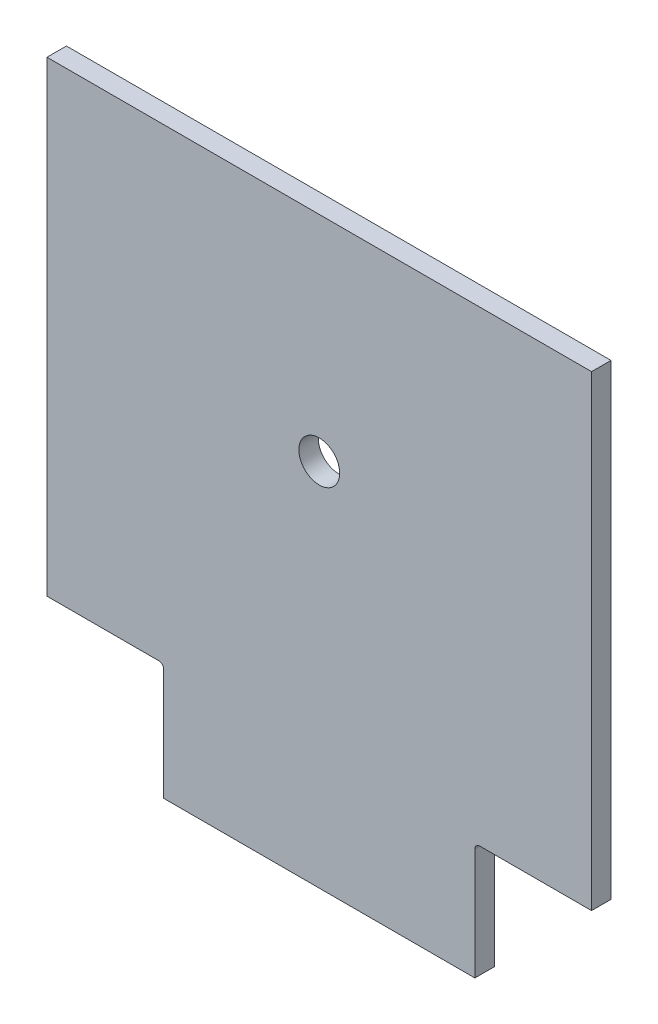
ISO-10303-21;
HEADER;
FILE_DESCRIPTION(('STEP AP214'),'2;1');
FILE_NAME('part.step','',(''),(''),'','','');
FILE_SCHEMA(('AUTOMOTIVE_DESIGN { 1 0 10303 214 1 1 1 1 }'));
ENDSEC;
DATA;
#1=APPLICATION_CONTEXT('core data for automotive mechanical design processes');
#2=APPLICATION_PROTOCOL_DEFINITION('international standard','automotive_design',2000,#1);
#3=PRODUCT_CONTEXT('',#1,'mechanical');
#4=PRODUCT('Part','Part','',(#3));
#5=PRODUCT_RELATED_PRODUCT_CATEGORY('part','',(#4));
#6=PRODUCT_DEFINITION_FORMATION('','',#4);
#7=PRODUCT_DEFINITION_CONTEXT('part definition',#1,'design');
#8=PRODUCT_DEFINITION('design','',#6,#7);
#9=PRODUCT_DEFINITION_SHAPE('','',#8);
#10=(LENGTH_UNIT() NAMED_UNIT(*) SI_UNIT(.MILLI.,.METRE.));
#11=(NAMED_UNIT(*) PLANE_ANGLE_UNIT() SI_UNIT($,.RADIAN.));
#12=(NAMED_UNIT(*) SI_UNIT($,.STERADIAN.) SOLID_ANGLE_UNIT());
#13=UNCERTAINTY_MEASURE_WITH_UNIT(LENGTH_MEASURE(1.E-05),#10,'distance_accuracy_value','');
#14=(GEOMETRIC_REPRESENTATION_CONTEXT(3) GLOBAL_UNCERTAINTY_ASSIGNED_CONTEXT((#13)) GLOBAL_UNIT_ASSIGNED_CONTEXT((#10,
#11,#12)) REPRESENTATION_CONTEXT('',''));
#15=CARTESIAN_POINT('',(0.,0.,0.));
#16=DIRECTION('',(0.,0.,1.));
#17=DIRECTION('',(1.,0.,0.));
#18=AXIS2_PLACEMENT_3D('',#15,#16,#17);
#19=CARTESIAN_POINT('',(0.,380.999999999962,6.35));
#20=DIRECTION('',(0.,1.,0.));
#21=DIRECTION('',(0.,0.,1.));
#22=AXIS2_PLACEMENT_3D('',#19,#20,#21);
#23=PLANE('',#22);
#24=DIRECTION('',(1.,0.,0.));
#25=VECTOR('',#24,1.);
#26=CARTESIAN_POINT('',(0.,380.999999999962,-6.35));
#27=LINE('',#26,#25);
#28=CARTESIAN_POINT('',(732.359999999964,380.999999999962,-6.35));
#29=VERTEX_POINT('',#28);
#30=CARTESIAN_POINT('',(805.384999999964,380.999999999962,-6.35));
#31=VERTEX_POINT('',#30);
#32=EDGE_CURVE('E156',#29,#31,#27,.T.);
#33=ORIENTED_EDGE('',*,*,#32,.T.);
#34=DIRECTION('',(0.,0.,-1.));
#35=VECTOR('',#34,1.);
#36=CARTESIAN_POINT('',(805.384999999964,380.999999999962,6.35));
#37=LINE('',#36,#35);
#38=CARTESIAN_POINT('',(805.384999999964,380.999999999962,6.35));
#39=VERTEX_POINT('',#38);
#40=EDGE_CURVE('E67',#31,#39,#37,.F.);
#41=ORIENTED_EDGE('',*,*,#40,.T.);
#42=DIRECTION('',(1.,0.,0.));
#43=VECTOR('',#42,1.);
#44=CARTESIAN_POINT('',(0.,380.999999999962,6.35));
#45=LINE('',#44,#43);
#46=CARTESIAN_POINT('',(732.359999999964,380.999999999962,6.35));
#47=VERTEX_POINT('',#46);
#48=EDGE_CURVE('E167',#47,#39,#45,.T.);
#49=ORIENTED_EDGE('',*,*,#48,.F.);
#50=DIRECTION('',(0.,0.,-1.));
#51=VECTOR('',#50,1.);
#52=CARTESIAN_POINT('',(732.359999999964,380.999999999962,6.35));
#53=LINE('',#52,#51);
#54=EDGE_CURVE('E160',#47,#29,#53,.T.);
#55=ORIENTED_EDGE('',*,*,#54,.T.);
#56=EDGE_LOOP('',(#33,#41,#49,#55));
#57=FACE_BOUND('',#56,.T.);
#58=ADVANCED_FACE('F45',(#57),#23,.F.);
#59=CARTESIAN_POINT('',(1014.93499999996,380.999999999962,6.35));
#60=VERTEX_POINT('',#59);
#61=CARTESIAN_POINT('',(1087.95999999996,380.999999999962,6.35));
#62=VERTEX_POINT('',#61);
#63=EDGE_CURVE('E142',#60,#62,#45,.T.);
#64=ORIENTED_EDGE('',*,*,#63,.F.);
#65=DIRECTION('',(0.,0.,1.));
#66=VECTOR('',#65,1.);
#67=CARTESIAN_POINT('',(1014.93499999996,380.999999999962,-6.35));
#68=LINE('',#67,#66);
#69=CARTESIAN_POINT('',(1014.93499999996,380.999999999962,-6.35));
#70=VERTEX_POINT('',#69);
#71=EDGE_CURVE('E211',#60,#70,#68,.F.);
#72=ORIENTED_EDGE('',*,*,#71,.T.);
#73=CARTESIAN_POINT('',(1087.95999999996,380.999999999962,-6.35));
#74=VERTEX_POINT('',#73);
#75=EDGE_CURVE('E159',#70,#74,#27,.T.);
#76=ORIENTED_EDGE('',*,*,#75,.T.);
#77=DIRECTION('',(0.,0.,-1.));
#78=VECTOR('',#77,1.);
#79=CARTESIAN_POINT('',(1087.95999999996,380.999999999962,6.35));
#80=LINE('',#79,#78);
#81=EDGE_CURVE('E147',#62,#74,#80,.T.);
#82=ORIENTED_EDGE('',*,*,#81,.F.);
#83=EDGE_LOOP('',(#64,#72,#76,#82));
#84=FACE_BOUND('',#83,.T.);
#85=ADVANCED_FACE('F241',(#84),#23,.F.);
#86=CARTESIAN_POINT('',(-1.41063631364129E-12,685.79999999996,6.35));
#87=DIRECTION('',(0.,1.,0.));
#88=DIRECTION('',(-1.,0.,0.));
#89=AXIS2_PLACEMENT_3D('',#86,#87,#88);
#90=PLANE('',#89);
#91=DIRECTION('',(1.,0.,0.));
#92=VECTOR('',#91,1.);
#93=CARTESIAN_POINT('',(-1.41063631364129E-12,685.79999999996,-6.35));
#94=LINE('',#93,#92);
#95=CARTESIAN_POINT('',(732.359999999964,685.799999999962,-6.35));
#96=VERTEX_POINT('',#95);
#97=CARTESIAN_POINT('',(1087.95999999996,685.799999999962,-6.35));
#98=VERTEX_POINT('',#97);
#99=EDGE_CURVE('E126',#96,#98,#94,.T.);
#100=ORIENTED_EDGE('',*,*,#99,.F.);
#101=DIRECTION('',(0.,0.,-1.));
#102=VECTOR('',#101,1.);
#103=CARTESIAN_POINT('',(732.359999999964,685.799999999962,6.35));
#104=LINE('',#103,#102);
#105=CARTESIAN_POINT('',(732.359999999964,685.799999999962,6.35));
#106=VERTEX_POINT('',#105);
#107=EDGE_CURVE('E162',#106,#96,#104,.T.);
#108=ORIENTED_EDGE('',*,*,#107,.F.);
#109=DIRECTION('',(1.,0.,0.));
#110=VECTOR('',#109,1.);
#111=CARTESIAN_POINT('',(-1.41063631364129E-12,685.79999999996,6.35));
#112=LINE('',#111,#110);
#113=CARTESIAN_POINT('',(1087.95999999996,685.799999999962,6.35));
#114=VERTEX_POINT('',#113);
#115=EDGE_CURVE('E128',#106,#114,#112,.T.);
#116=ORIENTED_EDGE('',*,*,#115,.T.);
#117=DIRECTION('',(0.,0.,-1.));
#118=VECTOR('',#117,1.);
#119=CARTESIAN_POINT('',(1087.95999999996,685.799999999962,6.35));
#120=LINE('',#119,#118);
#121=EDGE_CURVE('E123',#114,#98,#120,.T.);
#122=ORIENTED_EDGE('',*,*,#121,.T.);
#123=EDGE_LOOP('',(#100,#108,#116,#122));
#124=FACE_BOUND('',#123,.T.);
#125=ADVANCED_FACE('F125',(#124),#90,.T.);
#126=CARTESIAN_POINT('',(732.359999999964,0.,6.35));
#127=DIRECTION('',(1.,0.,0.));
#128=DIRECTION('',(0.,0.,-1.));
#129=AXIS2_PLACEMENT_3D('',#126,#127,#128);
#130=PLANE('',#129);
#131=DIRECTION('',(0.,-1.,0.));
#132=VECTOR('',#131,1.);
#133=CARTESIAN_POINT('',(732.359999999964,0.,-6.35));
#134=LINE('',#133,#132);
#135=EDGE_CURVE('E134',#96,#29,#134,.T.);
#136=ORIENTED_EDGE('',*,*,#135,.T.);
#137=ORIENTED_EDGE('',*,*,#54,.F.);
#138=DIRECTION('',(0.,-1.,0.));
#139=VECTOR('',#138,1.);
#140=CARTESIAN_POINT('',(732.359999999964,0.,6.35));
#141=LINE('',#140,#139);
#142=EDGE_CURVE('E171',#106,#47,#141,.T.);
#143=ORIENTED_EDGE('',*,*,#142,.F.);
#144=ORIENTED_EDGE('',*,*,#107,.T.);
#145=EDGE_LOOP('',(#136,#137,#143,#144));
#146=FACE_BOUND('',#145,.T.);
#147=ADVANCED_FACE('F253',(#146),#130,.F.);
#148=CARTESIAN_POINT('',(1087.95999999996,0.,6.35));
#149=DIRECTION('',(1.,0.,0.));
#150=DIRECTION('',(0.,0.,-1.));
#151=AXIS2_PLACEMENT_3D('',#148,#149,#150);
#152=PLANE('',#151);
#153=DIRECTION('',(0.,-1.,0.));
#154=VECTOR('',#153,1.);
#155=CARTESIAN_POINT('',(1087.95999999996,0.,-6.35));
#156=LINE('',#155,#154);
#157=EDGE_CURVE('E140',#98,#74,#156,.T.);
#158=ORIENTED_EDGE('',*,*,#157,.F.);
#159=ORIENTED_EDGE('',*,*,#121,.F.);
#160=DIRECTION('',(0.,-1.,0.));
#161=VECTOR('',#160,1.);
#162=CARTESIAN_POINT('',(1087.95999999996,0.,6.35));
#163=LINE('',#162,#161);
#164=EDGE_CURVE('E164',#114,#62,#163,.T.);
#165=ORIENTED_EDGE('',*,*,#164,.T.);
#166=ORIENTED_EDGE('',*,*,#81,.T.);
#167=EDGE_LOOP('',(#158,#159,#165,#166));
#168=FACE_BOUND('',#167,.T.);
#169=ADVANCED_FACE('F145',(#168),#152,.T.);
#170=CARTESIAN_POINT('',(0.,0.,6.35));
#171=DIRECTION('',(0.,0.,1.));
#172=DIRECTION('',(1.,0.,0.));
#173=AXIS2_PLACEMENT_3D('',#170,#171,#172);
#174=PLANE('',#173);
#175=CARTESIAN_POINT('',(910.15999999998,546.099999999962,6.34999999999999));
#176=DIRECTION('',(0.,0.,1.));
#177=DIRECTION('',(1.,0.,0.));
#178=AXIS2_PLACEMENT_3D('',#175,#176,#177);
#179=CIRCLE('',#178,13.335);
#180=CARTESIAN_POINT('',(923.49499999998,546.099999999962,6.34999999999999));
#181=VERTEX_POINT('',#180);
#182=EDGE_CURVE('E174',#181,#181,#179,.F.);
#183=ORIENTED_EDGE('',*,*,#182,.T.);
#184=EDGE_LOOP('',(#183));
#185=FACE_BOUND('',#184,.T.);
#186=ORIENTED_EDGE('',*,*,#115,.F.);
#187=ORIENTED_EDGE('',*,*,#142,.T.);
#188=ORIENTED_EDGE('',*,*,#48,.T.);
#189=CARTESIAN_POINT('',(805.384999999964,377.824999999962,6.35));
#190=DIRECTION('',(0.,0.,1.));
#191=DIRECTION('',(1.,0.,0.));
#192=AXIS2_PLACEMENT_3D('',#189,#190,#191);
#193=CIRCLE('',#192,3.175);
#194=CARTESIAN_POINT('',(808.559999999964,377.824999999962,6.35));
#195=VERTEX_POINT('',#194);
#196=EDGE_CURVE('E12',#39,#195,#193,.F.);
#197=ORIENTED_EDGE('',*,*,#196,.T.);
#198=DIRECTION('',(0.,1.,0.));
#199=VECTOR('',#198,1.);
#200=CARTESIAN_POINT('',(808.559999999964,304.799999999962,6.35));
#201=LINE('',#200,#199);
#202=CARTESIAN_POINT('',(808.559999999964,304.799999999962,6.35));
#203=VERTEX_POINT('',#202);
#204=EDGE_CURVE('E152',#203,#195,#201,.T.);
#205=ORIENTED_EDGE('',*,*,#204,.F.);
#206=DIRECTION('',(-1.,0.,0.));
#207=VECTOR('',#206,1.);
#208=CARTESIAN_POINT('',(808.559999999964,304.799999999962,6.35));
#209=LINE('',#208,#207);
#210=CARTESIAN_POINT('',(1011.75999999996,304.799999999962,6.35));
#211=VERTEX_POINT('',#210);
#212=EDGE_CURVE('E188',#211,#203,#209,.T.);
#213=ORIENTED_EDGE('',*,*,#212,.F.);
#214=DIRECTION('',(0.,1.,0.));
#215=VECTOR('',#214,1.);
#216=CARTESIAN_POINT('',(1011.75999999996,304.799999999962,6.35));
#217=LINE('',#216,#215);
#218=CARTESIAN_POINT('',(1011.75999999996,377.824999999962,6.35));
#219=VERTEX_POINT('',#218);
#220=EDGE_CURVE('E170',#211,#219,#217,.T.);
#221=ORIENTED_EDGE('',*,*,#220,.T.);
#222=CARTESIAN_POINT('',(1014.93499999996,377.824999999962,6.35));
#223=DIRECTION('',(0.,0.,1.));
#224=DIRECTION('',(1.,0.,0.));
#225=AXIS2_PLACEMENT_3D('',#222,#223,#224);
#226=CIRCLE('',#225,3.175);
#227=EDGE_CURVE('E220',#219,#60,#226,.F.);
#228=ORIENTED_EDGE('',*,*,#227,.T.);
#229=ORIENTED_EDGE('',*,*,#63,.T.);
#230=ORIENTED_EDGE('',*,*,#164,.F.);
#231=EDGE_LOOP('',(#186,#187,#188,#197,#205,#213,#221,#228,#229,#230));
#232=FACE_BOUND('',#231,.T.);
#233=ADVANCED_FACE('F238',(#185,#232),#174,.T.);
#234=CARTESIAN_POINT('',(0.,0.,-6.35));
#235=DIRECTION('',(0.,0.,1.));
#236=DIRECTION('',(1.,0.,0.));
#237=AXIS2_PLACEMENT_3D('',#234,#235,#236);
#238=PLANE('',#237);
#239=CARTESIAN_POINT('',(910.15999999998,546.099999999962,-6.34999999999999));
#240=DIRECTION('',(0.,0.,1.));
#241=DIRECTION('',(1.,0.,0.));
#242=AXIS2_PLACEMENT_3D('',#239,#240,#241);
#243=CIRCLE('',#242,13.335);
#244=CARTESIAN_POINT('',(923.49499999998,546.099999999962,-6.34999999999999));
#245=VERTEX_POINT('',#244);
#246=EDGE_CURVE('E191',#245,#245,#243,.F.);
#247=ORIENTED_EDGE('',*,*,#246,.F.);
#248=EDGE_LOOP('',(#247));
#249=FACE_BOUND('',#248,.T.);
#250=ORIENTED_EDGE('',*,*,#99,.T.);
#251=ORIENTED_EDGE('',*,*,#157,.T.);
#252=ORIENTED_EDGE('',*,*,#75,.F.);
#253=CARTESIAN_POINT('',(1014.93499999996,377.824999999962,-6.35));
#254=DIRECTION('',(0.,0.,1.));
#255=DIRECTION('',(1.,0.,0.));
#256=AXIS2_PLACEMENT_3D('',#253,#254,#255);
#257=CIRCLE('',#256,3.175);
#258=CARTESIAN_POINT('',(1011.75999999996,377.824999999962,-6.35));
#259=VERTEX_POINT('',#258);
#260=EDGE_CURVE('E223',#70,#259,#257,.T.);
#261=ORIENTED_EDGE('',*,*,#260,.T.);
#262=DIRECTION('',(0.,1.,0.));
#263=VECTOR('',#262,1.);
#264=CARTESIAN_POINT('',(1011.75999999996,304.799999999962,-6.35));
#265=LINE('',#264,#263);
#266=CARTESIAN_POINT('',(1011.75999999996,304.799999999962,-6.35));
#267=VERTEX_POINT('',#266);
#268=EDGE_CURVE('E177',#267,#259,#265,.T.);
#269=ORIENTED_EDGE('',*,*,#268,.F.);
#270=DIRECTION('',(1.,0.,0.));
#271=VECTOR('',#270,1.);
#272=CARTESIAN_POINT('',(808.559999999964,304.799999999962,-6.35));
#273=LINE('',#272,#271);
#274=CARTESIAN_POINT('',(808.559999999964,304.799999999962,-6.35));
#275=VERTEX_POINT('',#274);
#276=EDGE_CURVE('E195',#275,#267,#273,.T.);
#277=ORIENTED_EDGE('',*,*,#276,.F.);
#278=DIRECTION('',(0.,1.,0.));
#279=VECTOR('',#278,1.);
#280=CARTESIAN_POINT('',(808.559999999964,304.799999999962,-6.35));
#281=LINE('',#280,#279);
#282=CARTESIAN_POINT('',(808.559999999964,377.824999999962,-6.35));
#283=VERTEX_POINT('',#282);
#284=EDGE_CURVE('E149',#275,#283,#281,.T.);
#285=ORIENTED_EDGE('',*,*,#284,.T.);
#286=CARTESIAN_POINT('',(805.384999999964,377.824999999962,-6.35));
#287=DIRECTION('',(0.,0.,1.));
#288=DIRECTION('',(1.,0.,0.));
#289=AXIS2_PLACEMENT_3D('',#286,#287,#288);
#290=CIRCLE('',#289,3.175);
#291=EDGE_CURVE('E54',#283,#31,#290,.T.);
#292=ORIENTED_EDGE('',*,*,#291,.T.);
#293=ORIENTED_EDGE('',*,*,#32,.F.);
#294=ORIENTED_EDGE('',*,*,#135,.F.);
#295=EDGE_LOOP('',(#250,#251,#252,#261,#269,#277,#285,#292,#293,#294));
#296=FACE_BOUND('',#295,.T.);
#297=ADVANCED_FACE('F138',(#249,#296),#238,.F.);
#298=CARTESIAN_POINT('',(808.559999999964,304.799999999962,6.35));
#299=DIRECTION('',(1.,0.,0.));
#300=DIRECTION('',(0.,0.,-1.));
#301=AXIS2_PLACEMENT_3D('',#298,#299,#300);
#302=PLANE('',#301);
#303=ORIENTED_EDGE('',*,*,#204,.T.);
#304=DIRECTION('',(0.,0.,-1.));
#305=VECTOR('',#304,1.);
#306=CARTESIAN_POINT('',(808.559999999964,377.824999999962,-6.35));
#307=LINE('',#306,#305);
#308=EDGE_CURVE('E214',#195,#283,#307,.T.);
#309=ORIENTED_EDGE('',*,*,#308,.T.);
#310=ORIENTED_EDGE('',*,*,#284,.F.);
#311=DIRECTION('',(0.,0.,-1.));
#312=VECTOR('',#311,1.);
#313=CARTESIAN_POINT('',(808.559999999964,304.799999999962,6.35));
#314=LINE('',#313,#312);
#315=EDGE_CURVE('E181',#203,#275,#314,.T.);
#316=ORIENTED_EDGE('',*,*,#315,.F.);
#317=EDGE_LOOP('',(#303,#309,#310,#316));
#318=FACE_BOUND('',#317,.T.);
#319=ADVANCED_FACE('F260',(#318),#302,.F.);
#320=CARTESIAN_POINT('',(1011.75999999996,304.799999999962,6.35));
#321=DIRECTION('',(-1.,0.,0.));
#322=DIRECTION('',(0.,0.,1.));
#323=AXIS2_PLACEMENT_3D('',#320,#321,#322);
#324=PLANE('',#323);
#325=ORIENTED_EDGE('',*,*,#268,.T.);
#326=DIRECTION('',(0.,0.,1.));
#327=VECTOR('',#326,1.);
#328=CARTESIAN_POINT('',(1011.75999999996,377.824999999962,6.35));
#329=LINE('',#328,#327);
#330=EDGE_CURVE('E207',#259,#219,#329,.T.);
#331=ORIENTED_EDGE('',*,*,#330,.T.);
#332=ORIENTED_EDGE('',*,*,#220,.F.);
#333=DIRECTION('',(0.,0.,1.));
#334=VECTOR('',#333,1.);
#335=CARTESIAN_POINT('',(1011.75999999996,304.799999999962,6.35));
#336=LINE('',#335,#334);
#337=EDGE_CURVE('E192',#267,#211,#336,.T.);
#338=ORIENTED_EDGE('',*,*,#337,.F.);
#339=EDGE_LOOP('',(#325,#331,#332,#338));
#340=FACE_BOUND('',#339,.T.);
#341=ADVANCED_FACE('F233',(#340),#324,.F.);
#342=CARTESIAN_POINT('',(0.,304.799999999962,0.));
#343=DIRECTION('',(0.,-1.,0.));
#344=DIRECTION('',(0.,0.,-1.));
#345=AXIS2_PLACEMENT_3D('',#342,#343,#344);
#346=PLANE('',#345);
#347=ORIENTED_EDGE('',*,*,#315,.T.);
#348=ORIENTED_EDGE('',*,*,#276,.T.);
#349=ORIENTED_EDGE('',*,*,#337,.T.);
#350=ORIENTED_EDGE('',*,*,#212,.T.);
#351=EDGE_LOOP('',(#347,#348,#349,#350));
#352=FACE_BOUND('',#351,.T.);
#353=ADVANCED_FACE('F263',(#352),#346,.T.);
#354=CARTESIAN_POINT('',(910.159999999983,546.099999999962,-200.));
#355=DIRECTION('',(0.,0.,1.));
#356=DIRECTION('',(1.,0.,0.));
#357=AXIS2_PLACEMENT_3D('',#354,#355,#356);
#358=CYLINDRICAL_SURFACE('',#357,13.335);
#359=ORIENTED_EDGE('',*,*,#182,.F.);
#360=EDGE_LOOP('',(#359));
#361=FACE_BOUND('',#360,.T.);
#362=ORIENTED_EDGE('',*,*,#246,.T.);
#363=EDGE_LOOP('',(#362));
#364=FACE_BOUND('',#363,.T.);
#365=ADVANCED_FACE('F265',(#361,#364),#358,.F.);
#366=CARTESIAN_POINT('',(1014.93499999996,377.824999999962,6.35));
#367=DIRECTION('',(0.,0.,-1.));
#368=DIRECTION('',(-1.,0.,0.));
#369=AXIS2_PLACEMENT_3D('',#366,#367,#368);
#370=CYLINDRICAL_SURFACE('',#369,3.175);
#371=ORIENTED_EDGE('',*,*,#260,.F.);
#372=ORIENTED_EDGE('',*,*,#71,.F.);
#373=ORIENTED_EDGE('',*,*,#227,.F.);
#374=ORIENTED_EDGE('',*,*,#330,.F.);
#375=EDGE_LOOP('',(#371,#372,#373,#374));
#376=FACE_BOUND('',#375,.T.);
#377=ADVANCED_FACE('F235',(#376),#370,.F.);
#378=CARTESIAN_POINT('',(805.384999999964,377.824999999962,6.35));
#379=DIRECTION('',(0.,0.,1.));
#380=DIRECTION('',(1.,0.,0.));
#381=AXIS2_PLACEMENT_3D('',#378,#379,#380);
#382=CYLINDRICAL_SURFACE('',#381,3.175);
#383=ORIENTED_EDGE('',*,*,#196,.F.);
#384=ORIENTED_EDGE('',*,*,#40,.F.);
#385=ORIENTED_EDGE('',*,*,#291,.F.);
#386=ORIENTED_EDGE('',*,*,#308,.F.);
#387=EDGE_LOOP('',(#383,#384,#385,#386));
#388=FACE_BOUND('',#387,.T.);
#389=ADVANCED_FACE('F47',(#388),#382,.F.);
#390=CLOSED_SHELL('',(#58,#85,#125,#147,#169,#233,#297,#319,#341,#353,#365,#377,#389));
#391=MANIFOLD_SOLID_BREP('B2',#390);
#392=ADVANCED_BREP_SHAPE_REPRESENTATION('',(#18,#391),#14);
#393=SHAPE_DEFINITION_REPRESENTATION(#9,#392);
ENDSEC;
END-ISO-10303-21;
